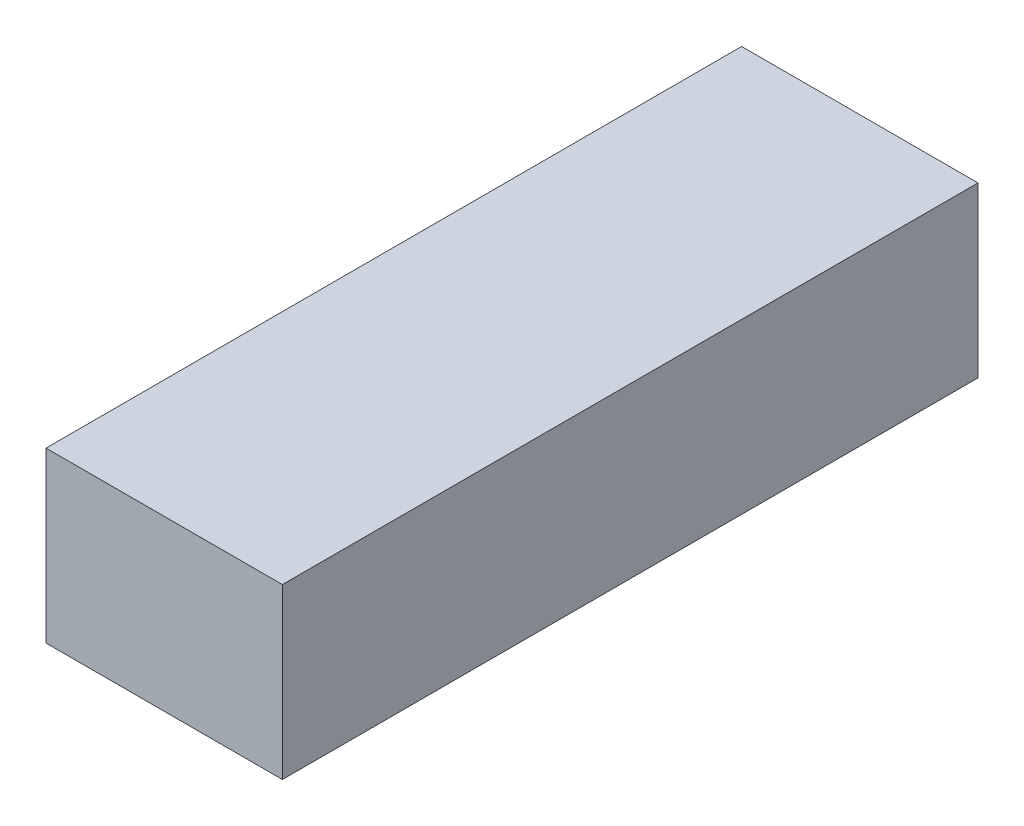
ISO-10303-21;
HEADER;
FILE_DESCRIPTION(('STEP AP214'),'2;1');
FILE_NAME('part.step','',(''),(''),'','','');
FILE_SCHEMA(('AUTOMOTIVE_DESIGN { 1 0 10303 214 1 1 1 1 }'));
ENDSEC;
DATA;
#1=APPLICATION_CONTEXT('core data for automotive mechanical design processes');
#2=APPLICATION_PROTOCOL_DEFINITION('international standard','automotive_design',2000,#1);
#3=PRODUCT_CONTEXT('',#1,'mechanical');
#4=PRODUCT('Part','Part','',(#3));
#5=PRODUCT_RELATED_PRODUCT_CATEGORY('part','',(#4));
#6=PRODUCT_DEFINITION_FORMATION('','',#4);
#7=PRODUCT_DEFINITION_CONTEXT('part definition',#1,'design');
#8=PRODUCT_DEFINITION('design','',#6,#7);
#9=PRODUCT_DEFINITION_SHAPE('','',#8);
#10=(LENGTH_UNIT() NAMED_UNIT(*) SI_UNIT(.MILLI.,.METRE.));
#11=(NAMED_UNIT(*) PLANE_ANGLE_UNIT() SI_UNIT($,.RADIAN.));
#12=(NAMED_UNIT(*) SI_UNIT($,.STERADIAN.) SOLID_ANGLE_UNIT());
#13=UNCERTAINTY_MEASURE_WITH_UNIT(LENGTH_MEASURE(1.E-05),#10,'distance_accuracy_value','');
#14=(GEOMETRIC_REPRESENTATION_CONTEXT(3) GLOBAL_UNCERTAINTY_ASSIGNED_CONTEXT((#13)) GLOBAL_UNIT_ASSIGNED_CONTEXT((#10,
#11,#12)) REPRESENTATION_CONTEXT('',''));
#15=CARTESIAN_POINT('',(0.,0.,0.));
#16=DIRECTION('',(0.,0.,1.));
#17=DIRECTION('',(1.,0.,0.));
#18=AXIS2_PLACEMENT_3D('',#15,#16,#17);
#19=CARTESIAN_POINT('',(0.,0.,103.));
#20=DIRECTION('',(1.,0.,0.));
#21=DIRECTION('',(0.,0.,-1.));
#22=AXIS2_PLACEMENT_3D('',#19,#20,#21);
#23=PLANE('',#22);
#24=DIRECTION('',(0.,-1.,0.));
#25=VECTOR('',#24,1.);
#26=CARTESIAN_POINT('',(0.,0.,0.));
#27=LINE('',#26,#25);
#28=CARTESIAN_POINT('',(0.,25.,0.));
#29=VERTEX_POINT('',#28);
#30=CARTESIAN_POINT('',(0.,0.,0.));
#31=VERTEX_POINT('',#30);
#32=EDGE_CURVE('E106',#29,#31,#27,.T.);
#33=ORIENTED_EDGE('',*,*,#32,.T.);
#34=DIRECTION('',(0.,0.,-1.));
#35=VECTOR('',#34,1.);
#36=CARTESIAN_POINT('',(0.,0.,103.));
#37=LINE('',#36,#35);
#38=CARTESIAN_POINT('',(0.,0.,103.));
#39=VERTEX_POINT('',#38);
#40=EDGE_CURVE('E11',#39,#31,#37,.T.);
#41=ORIENTED_EDGE('',*,*,#40,.F.);
#42=DIRECTION('',(0.,-1.,0.));
#43=VECTOR('',#42,1.);
#44=CARTESIAN_POINT('',(0.,0.,103.));
#45=LINE('',#44,#43);
#46=CARTESIAN_POINT('',(0.,25.,103.));
#47=VERTEX_POINT('',#46);
#48=EDGE_CURVE('E94',#47,#39,#45,.T.);
#49=ORIENTED_EDGE('',*,*,#48,.F.);
#50=DIRECTION('',(0.,0.,-1.));
#51=VECTOR('',#50,1.);
#52=CARTESIAN_POINT('',(0.,25.,103.));
#53=LINE('',#52,#51);
#54=EDGE_CURVE('E102',#47,#29,#53,.T.);
#55=ORIENTED_EDGE('',*,*,#54,.T.);
#56=EDGE_LOOP('',(#33,#41,#49,#55));
#57=FACE_BOUND('',#56,.T.);
#58=ADVANCED_FACE('F43',(#57),#23,.F.);
#59=CARTESIAN_POINT('',(0.,0.,103.));
#60=DIRECTION('',(0.,1.,0.));
#61=DIRECTION('',(0.,0.,1.));
#62=AXIS2_PLACEMENT_3D('',#59,#60,#61);
#63=PLANE('',#62);
#64=DIRECTION('',(1.,0.,0.));
#65=VECTOR('',#64,1.);
#66=CARTESIAN_POINT('',(0.,0.,0.));
#67=LINE('',#66,#65);
#68=CARTESIAN_POINT('',(35.,0.,0.));
#69=VERTEX_POINT('',#68);
#70=EDGE_CURVE('E98',#31,#69,#67,.T.);
#71=ORIENTED_EDGE('',*,*,#70,.T.);
#72=DIRECTION('',(0.,0.,-1.));
#73=VECTOR('',#72,1.);
#74=CARTESIAN_POINT('',(35.,0.,103.));
#75=LINE('',#74,#73);
#76=CARTESIAN_POINT('',(35.,0.,103.));
#77=VERTEX_POINT('',#76);
#78=EDGE_CURVE('E51',#77,#69,#75,.T.);
#79=ORIENTED_EDGE('',*,*,#78,.F.);
#80=DIRECTION('',(1.,0.,0.));
#81=VECTOR('',#80,1.);
#82=CARTESIAN_POINT('',(0.,0.,103.));
#83=LINE('',#82,#81);
#84=EDGE_CURVE('E89',#39,#77,#83,.T.);
#85=ORIENTED_EDGE('',*,*,#84,.F.);
#86=ORIENTED_EDGE('',*,*,#40,.T.);
#87=EDGE_LOOP('',(#71,#79,#85,#86));
#88=FACE_BOUND('',#87,.T.);
#89=ADVANCED_FACE('F97',(#88),#63,.F.);
#90=CARTESIAN_POINT('',(35.,0.,103.));
#91=DIRECTION('',(-1.,0.,0.));
#92=DIRECTION('',(0.,0.,1.));
#93=AXIS2_PLACEMENT_3D('',#90,#91,#92);
#94=PLANE('',#93);
#95=DIRECTION('',(0.,1.,0.));
#96=VECTOR('',#95,1.);
#97=CARTESIAN_POINT('',(35.,0.,0.));
#98=LINE('',#97,#96);
#99=CARTESIAN_POINT('',(35.,25.,0.));
#100=VERTEX_POINT('',#99);
#101=EDGE_CURVE('E76',#69,#100,#98,.T.);
#102=ORIENTED_EDGE('',*,*,#101,.T.);
#103=DIRECTION('',(0.,0.,-1.));
#104=VECTOR('',#103,1.);
#105=CARTESIAN_POINT('',(35.,25.,103.));
#106=LINE('',#105,#104);
#107=CARTESIAN_POINT('',(35.,25.,103.));
#108=VERTEX_POINT('',#107);
#109=EDGE_CURVE('E99',#108,#100,#106,.T.);
#110=ORIENTED_EDGE('',*,*,#109,.F.);
#111=DIRECTION('',(0.,1.,0.));
#112=VECTOR('',#111,1.);
#113=CARTESIAN_POINT('',(35.,0.,103.));
#114=LINE('',#113,#112);
#115=EDGE_CURVE('E92',#77,#108,#114,.T.);
#116=ORIENTED_EDGE('',*,*,#115,.F.);
#117=ORIENTED_EDGE('',*,*,#78,.T.);
#118=EDGE_LOOP('',(#102,#110,#116,#117));
#119=FACE_BOUND('',#118,.T.);
#120=ADVANCED_FACE('F100',(#119),#94,.F.);
#121=CARTESIAN_POINT('',(0.,25.,103.));
#122=DIRECTION('',(0.,-1.,0.));
#123=DIRECTION('',(0.,0.,-1.));
#124=AXIS2_PLACEMENT_3D('',#121,#122,#123);
#125=PLANE('',#124);
#126=DIRECTION('',(-1.,0.,0.));
#127=VECTOR('',#126,1.);
#128=CARTESIAN_POINT('',(0.,25.,0.));
#129=LINE('',#128,#127);
#130=EDGE_CURVE('E82',#100,#29,#129,.T.);
#131=ORIENTED_EDGE('',*,*,#130,.T.);
#132=ORIENTED_EDGE('',*,*,#54,.F.);
#133=DIRECTION('',(-1.,0.,0.));
#134=VECTOR('',#133,1.);
#135=CARTESIAN_POINT('',(0.,25.,103.));
#136=LINE('',#135,#134);
#137=EDGE_CURVE('E59',#108,#47,#136,.T.);
#138=ORIENTED_EDGE('',*,*,#137,.F.);
#139=ORIENTED_EDGE('',*,*,#109,.T.);
#140=EDGE_LOOP('',(#131,#132,#138,#139));
#141=FACE_BOUND('',#140,.T.);
#142=ADVANCED_FACE('F113',(#141),#125,.F.);
#143=CARTESIAN_POINT('',(0.,0.,103.));
#144=DIRECTION('',(0.,0.,-1.));
#145=DIRECTION('',(-1.,0.,0.));
#146=AXIS2_PLACEMENT_3D('',#143,#144,#145);
#147=PLANE('',#146);
#148=ORIENTED_EDGE('',*,*,#48,.T.);
#149=ORIENTED_EDGE('',*,*,#84,.T.);
#150=ORIENTED_EDGE('',*,*,#115,.T.);
#151=ORIENTED_EDGE('',*,*,#137,.T.);
#152=EDGE_LOOP('',(#148,#149,#150,#151));
#153=FACE_BOUND('',#152,.T.);
#154=ADVANCED_FACE('F90',(#153),#147,.F.);
#155=CARTESIAN_POINT('',(0.,0.,0.));
#156=DIRECTION('',(0.,0.,-1.));
#157=DIRECTION('',(-1.,0.,0.));
#158=AXIS2_PLACEMENT_3D('',#155,#156,#157);
#159=PLANE('',#158);
#160=ORIENTED_EDGE('',*,*,#32,.F.);
#161=ORIENTED_EDGE('',*,*,#130,.F.);
#162=ORIENTED_EDGE('',*,*,#101,.F.);
#163=ORIENTED_EDGE('',*,*,#70,.F.);
#164=EDGE_LOOP('',(#160,#161,#162,#163));
#165=FACE_BOUND('',#164,.T.);
#166=ADVANCED_FACE('F116',(#165),#159,.T.);
#167=CLOSED_SHELL('',(#58,#89,#120,#142,#154,#166));
#168=MANIFOLD_SOLID_BREP('B2',#167);
#169=ADVANCED_BREP_SHAPE_REPRESENTATION('',(#18,#168),#14);
#170=SHAPE_DEFINITION_REPRESENTATION(#9,#169);
ENDSEC;
END-ISO-10303-21;
